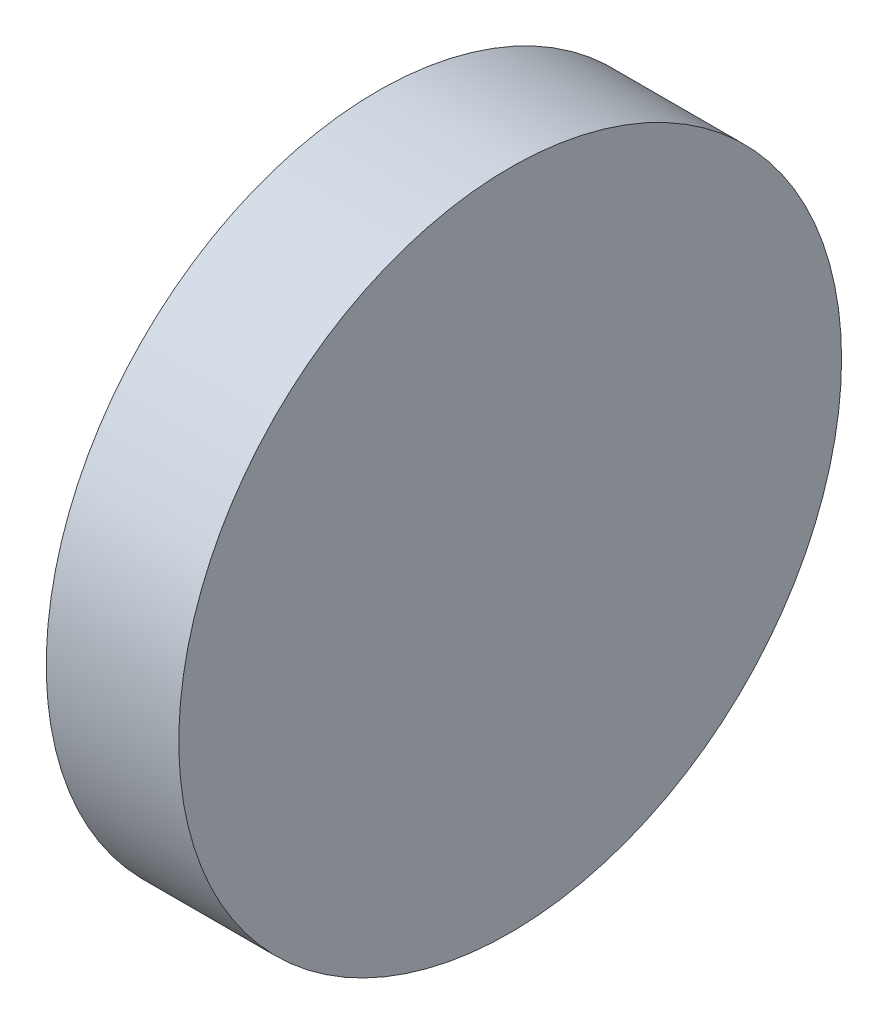
ISO-10303-21;
HEADER;
FILE_DESCRIPTION(('STEP AP214'),'2;1');
FILE_NAME('part.step','',(''),(''),'','','');
FILE_SCHEMA(('AUTOMOTIVE_DESIGN { 1 0 10303 214 1 1 1 1 }'));
ENDSEC;
DATA;
#1=APPLICATION_CONTEXT('core data for automotive mechanical design processes');
#2=APPLICATION_PROTOCOL_DEFINITION('international standard','automotive_design',2000,#1);
#3=PRODUCT_CONTEXT('',#1,'mechanical');
#4=PRODUCT('Part','Part','',(#3));
#5=PRODUCT_RELATED_PRODUCT_CATEGORY('part','',(#4));
#6=PRODUCT_DEFINITION_FORMATION('','',#4);
#7=PRODUCT_DEFINITION_CONTEXT('part definition',#1,'design');
#8=PRODUCT_DEFINITION('design','',#6,#7);
#9=PRODUCT_DEFINITION_SHAPE('','',#8);
#10=(LENGTH_UNIT() NAMED_UNIT(*) SI_UNIT(.MILLI.,.METRE.));
#11=(NAMED_UNIT(*) PLANE_ANGLE_UNIT() SI_UNIT($,.RADIAN.));
#12=(NAMED_UNIT(*) SI_UNIT($,.STERADIAN.) SOLID_ANGLE_UNIT());
#13=UNCERTAINTY_MEASURE_WITH_UNIT(LENGTH_MEASURE(1.E-05),#10,'distance_accuracy_value','');
#14=(GEOMETRIC_REPRESENTATION_CONTEXT(3) GLOBAL_UNCERTAINTY_ASSIGNED_CONTEXT((#13)) GLOBAL_UNIT_ASSIGNED_CONTEXT((#10,
#11,#12)) REPRESENTATION_CONTEXT('',''));
#15=CARTESIAN_POINT('',(0.,0.,0.));
#16=DIRECTION('',(0.,0.,1.));
#17=DIRECTION('',(1.,0.,0.));
#18=AXIS2_PLACEMENT_3D('',#15,#16,#17);
#19=CARTESIAN_POINT('',(12.7,0.,0.));
#20=DIRECTION('',(-1.,0.,0.));
#21=DIRECTION('',(0.,0.,1.));
#22=AXIS2_PLACEMENT_3D('',#19,#20,#21);
#23=CYLINDRICAL_SURFACE('',#22,31.75);
#24=CARTESIAN_POINT('',(12.7,0.,0.));
#25=DIRECTION('',(1.,0.,0.));
#26=DIRECTION('',(0.,0.,-1.));
#27=AXIS2_PLACEMENT_3D('',#24,#25,#26);
#28=CIRCLE('',#27,31.75);
#29=CARTESIAN_POINT('',(12.7,0.,-31.75));
#30=VERTEX_POINT('',#29);
#31=EDGE_CURVE('E10',#30,#30,#28,.T.);
#32=ORIENTED_EDGE('',*,*,#31,.F.);
#33=EDGE_LOOP('',(#32));
#34=FACE_BOUND('',#33,.T.);
#35=CARTESIAN_POINT('',(0.,0.,0.));
#36=DIRECTION('',(1.,0.,0.));
#37=DIRECTION('',(0.,0.,-1.));
#38=AXIS2_PLACEMENT_3D('',#35,#36,#37);
#39=CIRCLE('',#38,31.75);
#40=CARTESIAN_POINT('',(0.,0.,-31.75));
#41=VERTEX_POINT('',#40);
#42=EDGE_CURVE('E33',#41,#41,#39,.T.);
#43=ORIENTED_EDGE('',*,*,#42,.T.);
#44=EDGE_LOOP('',(#43));
#45=FACE_BOUND('',#44,.T.);
#46=ADVANCED_FACE('F30',(#34,#45),#23,.T.);
#47=CARTESIAN_POINT('',(12.7,0.,0.));
#48=DIRECTION('',(1.,0.,0.));
#49=DIRECTION('',(0.,0.,-1.));
#50=AXIS2_PLACEMENT_3D('',#47,#48,#49);
#51=PLANE('',#50);
#52=ORIENTED_EDGE('',*,*,#31,.T.);
#53=EDGE_LOOP('',(#52));
#54=FACE_BOUND('',#53,.T.);
#55=ADVANCED_FACE('F45',(#54),#51,.T.);
#56=CARTESIAN_POINT('',(0.,0.,0.));
#57=DIRECTION('',(1.,0.,0.));
#58=DIRECTION('',(0.,0.,-1.));
#59=AXIS2_PLACEMENT_3D('',#56,#57,#58);
#60=PLANE('',#59);
#61=ORIENTED_EDGE('',*,*,#42,.F.);
#62=EDGE_LOOP('',(#61));
#63=FACE_BOUND('',#62,.T.);
#64=ADVANCED_FACE('F43',(#63),#60,.F.);
#65=CLOSED_SHELL('',(#46,#55,#64));
#66=MANIFOLD_SOLID_BREP('B2',#65);
#67=ADVANCED_BREP_SHAPE_REPRESENTATION('',(#18,#66),#14);
#68=SHAPE_DEFINITION_REPRESENTATION(#9,#67);
ENDSEC;
END-ISO-10303-21;
